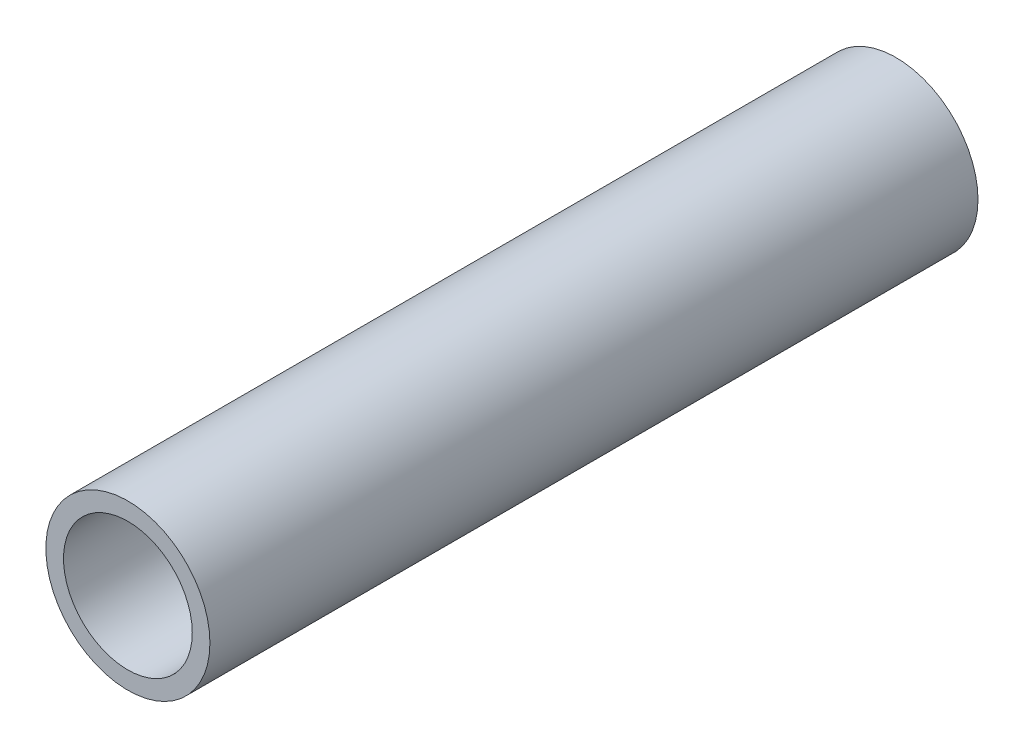
ISO-10303-21;
HEADER;
FILE_DESCRIPTION(('STEP AP214'),'2;1');
FILE_NAME('part.step','',(''),(''),'','','');
FILE_SCHEMA(('AUTOMOTIVE_DESIGN { 1 0 10303 214 1 1 1 1 }'));
ENDSEC;
DATA;
#1=APPLICATION_CONTEXT('core data for automotive mechanical design processes');
#2=APPLICATION_PROTOCOL_DEFINITION('international standard','automotive_design',2000,#1);
#3=PRODUCT_CONTEXT('',#1,'mechanical');
#4=PRODUCT('Part','Part','',(#3));
#5=PRODUCT_RELATED_PRODUCT_CATEGORY('part','',(#4));
#6=PRODUCT_DEFINITION_FORMATION('','',#4);
#7=PRODUCT_DEFINITION_CONTEXT('part definition',#1,'design');
#8=PRODUCT_DEFINITION('design','',#6,#7);
#9=PRODUCT_DEFINITION_SHAPE('','',#8);
#10=(LENGTH_UNIT() NAMED_UNIT(*) SI_UNIT(.MILLI.,.METRE.));
#11=(NAMED_UNIT(*) PLANE_ANGLE_UNIT() SI_UNIT($,.RADIAN.));
#12=(NAMED_UNIT(*) SI_UNIT($,.STERADIAN.) SOLID_ANGLE_UNIT());
#13=UNCERTAINTY_MEASURE_WITH_UNIT(LENGTH_MEASURE(1.E-05),#10,'distance_accuracy_value','');
#14=(GEOMETRIC_REPRESENTATION_CONTEXT(3) GLOBAL_UNCERTAINTY_ASSIGNED_CONTEXT((#13)) GLOBAL_UNIT_ASSIGNED_CONTEXT((#10,
#11,#12)) REPRESENTATION_CONTEXT('',''));
#15=CARTESIAN_POINT('',(0.,0.,0.));
#16=DIRECTION('',(0.,0.,1.));
#17=DIRECTION('',(1.,0.,0.));
#18=AXIS2_PLACEMENT_3D('',#15,#16,#17);
#19=CARTESIAN_POINT('',(0.,0.,762.));
#20=DIRECTION('',(0.,0.,-1.));
#21=DIRECTION('',(-1.,0.,0.));
#22=AXIS2_PLACEMENT_3D('',#19,#20,#21);
#23=CYLINDRICAL_SURFACE('',#22,13.335);
#24=CARTESIAN_POINT('',(0.,0.,-762.));
#25=DIRECTION('',(0.,0.,1.));
#26=DIRECTION('',(1.,0.,0.));
#27=AXIS2_PLACEMENT_3D('',#24,#25,#26);
#28=CIRCLE('',#27,13.335);
#29=CARTESIAN_POINT('',(13.335,0.,-762.));
#30=VERTEX_POINT('',#29);
#31=EDGE_CURVE('E11',#30,#30,#28,.T.);
#32=ORIENTED_EDGE('',*,*,#31,.T.);
#33=EDGE_LOOP('',(#32));
#34=FACE_BOUND('',#33,.T.);
#35=CARTESIAN_POINT('',(0.,0.,-637.15546875));
#36=DIRECTION('',(0.,0.,1.));
#37=DIRECTION('',(1.,0.,0.));
#38=AXIS2_PLACEMENT_3D('',#35,#36,#37);
#39=CIRCLE('',#38,13.335);
#40=CARTESIAN_POINT('',(13.335,0.,-637.15546875));
#41=VERTEX_POINT('',#40);
#42=EDGE_CURVE('E58',#41,#41,#39,.F.);
#43=ORIENTED_EDGE('',*,*,#42,.T.);
#44=EDGE_LOOP('',(#43));
#45=FACE_BOUND('',#44,.T.);
#46=ADVANCED_FACE('F43',(#34,#45),#23,.T.);
#47=CARTESIAN_POINT('',(0.,0.,762.));
#48=DIRECTION('',(0.,0.,-1.));
#49=DIRECTION('',(-1.,0.,0.));
#50=AXIS2_PLACEMENT_3D('',#47,#48,#49);
#51=CYLINDRICAL_SURFACE('',#50,10.4648);
#52=CARTESIAN_POINT('',(0.,0.,-762.));
#53=DIRECTION('',(0.,0.,1.));
#54=DIRECTION('',(1.,0.,0.));
#55=AXIS2_PLACEMENT_3D('',#52,#53,#54);
#56=CIRCLE('',#55,10.4648);
#57=CARTESIAN_POINT('',(10.4648,0.,-762.));
#58=VERTEX_POINT('',#57);
#59=EDGE_CURVE('E51',#58,#58,#56,.T.);
#60=ORIENTED_EDGE('',*,*,#59,.F.);
#61=EDGE_LOOP('',(#60));
#62=FACE_BOUND('',#61,.T.);
#63=CARTESIAN_POINT('',(0.,0.,-637.15546875));
#64=DIRECTION('',(0.,0.,1.));
#65=DIRECTION('',(1.,0.,0.));
#66=AXIS2_PLACEMENT_3D('',#63,#64,#65);
#67=CIRCLE('',#66,10.4648);
#68=CARTESIAN_POINT('',(10.4648,0.,-637.15546875));
#69=VERTEX_POINT('',#68);
#70=EDGE_CURVE('E46',#69,#69,#67,.T.);
#71=ORIENTED_EDGE('',*,*,#70,.T.);
#72=EDGE_LOOP('',(#71));
#73=FACE_BOUND('',#72,.T.);
#74=ADVANCED_FACE('F67',(#62,#73),#51,.F.);
#75=CARTESIAN_POINT('',(0.,0.,-762.));
#76=DIRECTION('',(0.,0.,1.));
#77=DIRECTION('',(1.,0.,0.));
#78=AXIS2_PLACEMENT_3D('',#75,#76,#77);
#79=PLANE('',#78);
#80=ORIENTED_EDGE('',*,*,#59,.T.);
#81=EDGE_LOOP('',(#80));
#82=FACE_BOUND('',#81,.T.);
#83=ORIENTED_EDGE('',*,*,#31,.F.);
#84=EDGE_LOOP('',(#83));
#85=FACE_BOUND('',#84,.T.);
#86=ADVANCED_FACE('F72',(#82,#85),#79,.F.);
#87=CARTESIAN_POINT('',(0.,0.,-637.15546875));
#88=DIRECTION('',(0.,0.,1.));
#89=DIRECTION('',(1.,0.,0.));
#90=AXIS2_PLACEMENT_3D('',#87,#88,#89);
#91=PLANE('',#90);
#92=ORIENTED_EDGE('',*,*,#70,.F.);
#93=EDGE_LOOP('',(#92));
#94=FACE_BOUND('',#93,.T.);
#95=ORIENTED_EDGE('',*,*,#42,.F.);
#96=EDGE_LOOP('',(#95));
#97=FACE_BOUND('',#96,.T.);
#98=ADVANCED_FACE('F69',(#94,#97),#91,.T.);
#99=CLOSED_SHELL('',(#46,#74,#86,#98));
#100=MANIFOLD_SOLID_BREP('B2',#99);
#101=ADVANCED_BREP_SHAPE_REPRESENTATION('',(#18,#100),#14);
#102=SHAPE_DEFINITION_REPRESENTATION(#9,#101);
ENDSEC;
END-ISO-10303-21;
